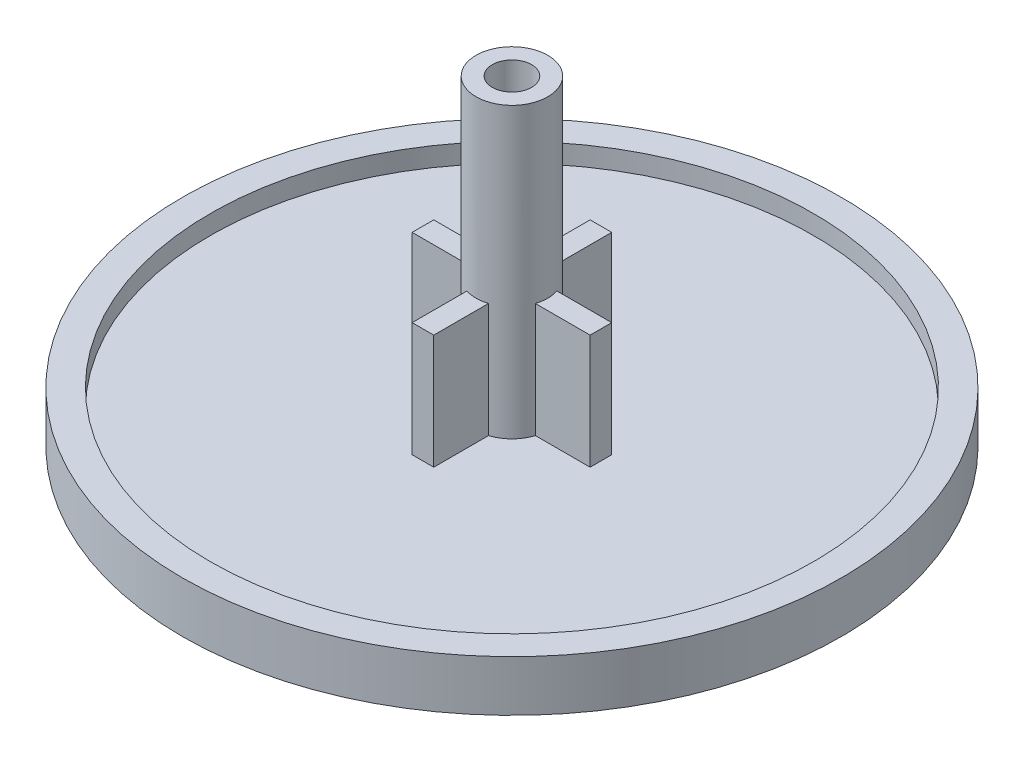
ISO-10303-21;
HEADER;
FILE_DESCRIPTION(('STEP AP214'),'2;1');
FILE_NAME('part.step','',(''),(''),'','','');
FILE_SCHEMA(('AUTOMOTIVE_DESIGN { 1 0 10303 214 1 1 1 1 }'));
ENDSEC;
DATA;
#1=APPLICATION_CONTEXT('core data for automotive mechanical design processes');
#2=APPLICATION_PROTOCOL_DEFINITION('international standard','automotive_design',2000,#1);
#3=PRODUCT_CONTEXT('',#1,'mechanical');
#4=PRODUCT('Part','Part','',(#3));
#5=PRODUCT_RELATED_PRODUCT_CATEGORY('part','',(#4));
#6=PRODUCT_DEFINITION_FORMATION('','',#4);
#7=PRODUCT_DEFINITION_CONTEXT('part definition',#1,'design');
#8=PRODUCT_DEFINITION('design','',#6,#7);
#9=PRODUCT_DEFINITION_SHAPE('','',#8);
#10=(LENGTH_UNIT() NAMED_UNIT(*) SI_UNIT(.MILLI.,.METRE.));
#11=(NAMED_UNIT(*) PLANE_ANGLE_UNIT() SI_UNIT($,.RADIAN.));
#12=(NAMED_UNIT(*) SI_UNIT($,.STERADIAN.) SOLID_ANGLE_UNIT());
#13=UNCERTAINTY_MEASURE_WITH_UNIT(LENGTH_MEASURE(1.E-05),#10,'distance_accuracy_value','');
#14=(GEOMETRIC_REPRESENTATION_CONTEXT(3) GLOBAL_UNCERTAINTY_ASSIGNED_CONTEXT((#13)) GLOBAL_UNIT_ASSIGNED_CONTEXT((#10,
#11,#12)) REPRESENTATION_CONTEXT('',''));
#15=CARTESIAN_POINT('',(0.,0.,0.));
#16=DIRECTION('',(0.,0.,1.));
#17=DIRECTION('',(1.,0.,0.));
#18=AXIS2_PLACEMENT_3D('',#15,#16,#17);
#19=CARTESIAN_POINT('',(0.,1.27,0.));
#20=DIRECTION('',(0.,1.,0.));
#21=DIRECTION('',(0.,0.,1.));
#22=AXIS2_PLACEMENT_3D('',#19,#20,#21);
#23=PLANE('',#22);
#24=CARTESIAN_POINT('',(0.,1.27,0.));
#25=DIRECTION('',(0.,1.,0.));
#26=DIRECTION('',(0.,0.,1.));
#27=AXIS2_PLACEMENT_3D('',#24,#25,#26);
#28=CIRCLE('',#27,12.0523);
#29=CARTESIAN_POINT('',(0.,1.27,12.0523));
#30=VERTEX_POINT('',#29);
#31=EDGE_CURVE('E265',#30,#30,#28,.F.);
#32=ORIENTED_EDGE('',*,*,#31,.F.);
#33=EDGE_LOOP('',(#32));
#34=FACE_BOUND('',#33,.T.);
#35=DIRECTION('',(1.,0.,0.));
#36=VECTOR('',#35,1.);
#37=CARTESIAN_POINT('',(0.,1.27,-3.556));
#38=LINE('',#37,#36);
#39=CARTESIAN_POINT('',(-0.4318,1.27,-3.556));
#40=VERTEX_POINT('',#39);
#41=CARTESIAN_POINT('',(0.4318,1.27,-3.556));
#42=VERTEX_POINT('',#41);
#43=EDGE_CURVE('E211',#40,#42,#38,.T.);
#44=ORIENTED_EDGE('',*,*,#43,.T.);
#45=DIRECTION('',(0.,0.,1.));
#46=VECTOR('',#45,1.);
#47=CARTESIAN_POINT('',(0.4318,1.27,0.));
#48=LINE('',#47,#46);
#49=CARTESIAN_POINT('',(0.4318,1.27,-1.36859810390048));
#50=VERTEX_POINT('',#49);
#51=EDGE_CURVE('E168',#42,#50,#48,.T.);
#52=ORIENTED_EDGE('',*,*,#51,.T.);
#53=CARTESIAN_POINT('',(0.,1.27,0.));
#54=DIRECTION('',(0.,1.,0.));
#55=DIRECTION('',(0.,0.,1.));
#56=AXIS2_PLACEMENT_3D('',#53,#54,#55);
#57=CIRCLE('',#56,1.4351);
#58=CARTESIAN_POINT('',(1.36859810390048,1.27,-0.4318));
#59=VERTEX_POINT('',#58);
#60=EDGE_CURVE('E251',#59,#50,#57,.T.);
#61=ORIENTED_EDGE('',*,*,#60,.F.);
#62=DIRECTION('',(-1.,0.,0.));
#63=VECTOR('',#62,1.);
#64=CARTESIAN_POINT('',(0.,1.27,-0.4318));
#65=LINE('',#64,#63);
#66=CARTESIAN_POINT('',(3.556,1.27,-0.4318));
#67=VERTEX_POINT('',#66);
#68=EDGE_CURVE('E242',#67,#59,#65,.T.);
#69=ORIENTED_EDGE('',*,*,#68,.F.);
#70=DIRECTION('',(0.,0.,1.));
#71=VECTOR('',#70,1.);
#72=CARTESIAN_POINT('',(3.556,1.27,0.));
#73=LINE('',#72,#71);
#74=CARTESIAN_POINT('',(3.556,1.27,0.4318));
#75=VERTEX_POINT('',#74);
#76=EDGE_CURVE('E285',#67,#75,#73,.T.);
#77=ORIENTED_EDGE('',*,*,#76,.T.);
#78=DIRECTION('',(-1.,0.,0.));
#79=VECTOR('',#78,1.);
#80=CARTESIAN_POINT('',(0.,1.27,0.4318));
#81=LINE('',#80,#79);
#82=CARTESIAN_POINT('',(1.36859810390048,1.27,0.4318));
#83=VERTEX_POINT('',#82);
#84=EDGE_CURVE('E246',#75,#83,#81,.T.);
#85=ORIENTED_EDGE('',*,*,#84,.T.);
#86=CARTESIAN_POINT('',(0.4318,1.27,1.36859810390048));
#87=VERTEX_POINT('',#86);
#88=EDGE_CURVE('E256',#87,#83,#57,.T.);
#89=ORIENTED_EDGE('',*,*,#88,.F.);
#90=CARTESIAN_POINT('',(0.4318,1.27,3.556));
#91=VERTEX_POINT('',#90);
#92=EDGE_CURVE('E206',#87,#91,#48,.T.);
#93=ORIENTED_EDGE('',*,*,#92,.T.);
#94=DIRECTION('',(-1.,0.,0.));
#95=VECTOR('',#94,1.);
#96=CARTESIAN_POINT('',(0.,1.27,3.556));
#97=LINE('',#96,#95);
#98=CARTESIAN_POINT('',(-0.4318,1.27,3.556));
#99=VERTEX_POINT('',#98);
#100=EDGE_CURVE('E213',#91,#99,#97,.T.);
#101=ORIENTED_EDGE('',*,*,#100,.T.);
#102=DIRECTION('',(0.,0.,1.));
#103=VECTOR('',#102,1.);
#104=CARTESIAN_POINT('',(-0.4318,1.27,0.));
#105=LINE('',#104,#103);
#106=CARTESIAN_POINT('',(-0.4318,1.27,1.36859810390048));
#107=VERTEX_POINT('',#106);
#108=EDGE_CURVE('E200',#107,#99,#105,.T.);
#109=ORIENTED_EDGE('',*,*,#108,.F.);
#110=CARTESIAN_POINT('',(-1.36859810390048,1.27,0.4318));
#111=VERTEX_POINT('',#110);
#112=EDGE_CURVE('E252',#111,#107,#57,.T.);
#113=ORIENTED_EDGE('',*,*,#112,.F.);
#114=CARTESIAN_POINT('',(-3.556,1.27,0.4318));
#115=VERTEX_POINT('',#114);
#116=EDGE_CURVE('E243',#111,#115,#81,.T.);
#117=ORIENTED_EDGE('',*,*,#116,.T.);
#118=DIRECTION('',(0.,0.,-1.));
#119=VECTOR('',#118,1.);
#120=CARTESIAN_POINT('',(-3.556,1.27,0.));
#121=LINE('',#120,#119);
#122=CARTESIAN_POINT('',(-3.556,1.27,-0.4318));
#123=VERTEX_POINT('',#122);
#124=EDGE_CURVE('E283',#115,#123,#121,.T.);
#125=ORIENTED_EDGE('',*,*,#124,.T.);
#126=CARTESIAN_POINT('',(-1.36859810390048,1.27,-0.4318));
#127=VERTEX_POINT('',#126);
#128=EDGE_CURVE('E240',#127,#123,#65,.T.);
#129=ORIENTED_EDGE('',*,*,#128,.F.);
#130=CARTESIAN_POINT('',(-0.4318,1.27,-1.36859810390048));
#131=VERTEX_POINT('',#130);
#132=EDGE_CURVE('E255',#131,#127,#57,.T.);
#133=ORIENTED_EDGE('',*,*,#132,.F.);
#134=EDGE_CURVE('E71',#40,#131,#105,.T.);
#135=ORIENTED_EDGE('',*,*,#134,.F.);
#136=EDGE_LOOP('',(#44,#52,#61,#69,#77,#85,#89,#93,#101,#109,#113,#117,#125,#129,#133,#135));
#137=FACE_BOUND('',#136,.T.);
#138=ADVANCED_FACE('F48',(#34,#137),#23,.T.);
#139=CARTESIAN_POINT('',(0.,12.8143,0.));
#140=DIRECTION('',(0.,-1.,0.));
#141=DIRECTION('',(0.,0.,-1.));
#142=AXIS2_PLACEMENT_3D('',#139,#140,#141);
#143=CYLINDRICAL_SURFACE('',#142,1.4351);
#144=CARTESIAN_POINT('',(0.,12.8143,0.));
#145=DIRECTION('',(0.,1.,0.));
#146=DIRECTION('',(0.,0.,1.));
#147=AXIS2_PLACEMENT_3D('',#144,#145,#146);
#148=CIRCLE('',#147,1.4351);
#149=CARTESIAN_POINT('',(0.,12.8143,1.4351));
#150=VERTEX_POINT('',#149);
#151=EDGE_CURVE('E247',#150,#150,#148,.T.);
#152=ORIENTED_EDGE('',*,*,#151,.F.);
#153=EDGE_LOOP('',(#152));
#154=FACE_BOUND('',#153,.T.);
#155=DIRECTION('',(0.,-1.,0.));
#156=VECTOR('',#155,1.);
#157=CARTESIAN_POINT('',(0.4318,12.8143,-1.36859810390048));
#158=LINE('',#157,#156);
#159=CARTESIAN_POINT('',(0.4318,5.842,-1.36859810390048));
#160=VERTEX_POINT('',#159);
#161=EDGE_CURVE('E209',#160,#50,#158,.T.);
#162=ORIENTED_EDGE('',*,*,#161,.F.);
#163=CARTESIAN_POINT('',(0.,5.842,0.));
#164=DIRECTION('',(0.,-1.,0.));
#165=DIRECTION('',(0.,0.,-1.));
#166=AXIS2_PLACEMENT_3D('',#163,#164,#165);
#167=CIRCLE('',#166,1.4351);
#168=CARTESIAN_POINT('',(-0.4318,5.842,-1.36859810390048));
#169=VERTEX_POINT('',#168);
#170=EDGE_CURVE('E13',#169,#160,#167,.T.);
#171=ORIENTED_EDGE('',*,*,#170,.F.);
#172=DIRECTION('',(0.,-1.,0.));
#173=VECTOR('',#172,1.);
#174=CARTESIAN_POINT('',(-0.4318,12.8143,-1.36859810390048));
#175=LINE('',#174,#173);
#176=EDGE_CURVE('E202',#169,#131,#175,.T.);
#177=ORIENTED_EDGE('',*,*,#176,.T.);
#178=ORIENTED_EDGE('',*,*,#132,.T.);
#179=DIRECTION('',(0.,-1.,0.));
#180=VECTOR('',#179,1.);
#181=CARTESIAN_POINT('',(-1.36859810390048,12.8143,-0.4318));
#182=LINE('',#181,#180);
#183=CARTESIAN_POINT('',(-1.36859810390048,5.842,-0.4318));
#184=VERTEX_POINT('',#183);
#185=EDGE_CURVE('E268',#127,#184,#182,.F.);
#186=ORIENTED_EDGE('',*,*,#185,.T.);
#187=CARTESIAN_POINT('',(0.,5.842,0.));
#188=DIRECTION('',(0.,-1.,0.));
#189=DIRECTION('',(0.,0.,-1.));
#190=AXIS2_PLACEMENT_3D('',#187,#188,#189);
#191=CIRCLE('',#190,1.4351);
#192=CARTESIAN_POINT('',(-1.36859810390048,5.842,0.4318));
#193=VERTEX_POINT('',#192);
#194=EDGE_CURVE('E271',#193,#184,#191,.T.);
#195=ORIENTED_EDGE('',*,*,#194,.F.);
#196=DIRECTION('',(0.,-1.,0.));
#197=VECTOR('',#196,1.);
#198=CARTESIAN_POINT('',(-1.36859810390048,12.8143,0.4318));
#199=LINE('',#198,#197);
#200=EDGE_CURVE('E274',#111,#193,#199,.F.);
#201=ORIENTED_EDGE('',*,*,#200,.F.);
#202=ORIENTED_EDGE('',*,*,#112,.T.);
#203=DIRECTION('',(0.,-1.,0.));
#204=VECTOR('',#203,1.);
#205=CARTESIAN_POINT('',(-0.4318,12.8143,1.36859810390048));
#206=LINE('',#205,#204);
#207=CARTESIAN_POINT('',(-0.4318,5.842,1.36859810390048));
#208=VERTEX_POINT('',#207);
#209=EDGE_CURVE('E181',#107,#208,#206,.F.);
#210=ORIENTED_EDGE('',*,*,#209,.T.);
#211=CARTESIAN_POINT('',(0.4318,5.842,1.36859810390048));
#212=VERTEX_POINT('',#211);
#213=EDGE_CURVE('E52',#212,#208,#167,.T.);
#214=ORIENTED_EDGE('',*,*,#213,.F.);
#215=DIRECTION('',(0.,-1.,0.));
#216=VECTOR('',#215,1.);
#217=CARTESIAN_POINT('',(0.4318,12.8143,1.36859810390048));
#218=LINE('',#217,#216);
#219=EDGE_CURVE('E204',#87,#212,#218,.F.);
#220=ORIENTED_EDGE('',*,*,#219,.F.);
#221=ORIENTED_EDGE('',*,*,#88,.T.);
#222=DIRECTION('',(0.,-1.,0.));
#223=VECTOR('',#222,1.);
#224=CARTESIAN_POINT('',(1.36859810390048,12.8143,0.4318));
#225=LINE('',#224,#223);
#226=CARTESIAN_POINT('',(1.36859810390048,5.842,0.4318));
#227=VERTEX_POINT('',#226);
#228=EDGE_CURVE('E280',#227,#83,#225,.T.);
#229=ORIENTED_EDGE('',*,*,#228,.F.);
#230=CARTESIAN_POINT('',(1.36859810390048,5.842,-0.4318));
#231=VERTEX_POINT('',#230);
#232=EDGE_CURVE('E275',#231,#227,#191,.T.);
#233=ORIENTED_EDGE('',*,*,#232,.F.);
#234=DIRECTION('',(0.,-1.,0.));
#235=VECTOR('',#234,1.);
#236=CARTESIAN_POINT('',(1.36859810390048,12.8143,-0.4318));
#237=LINE('',#236,#235);
#238=EDGE_CURVE('E277',#231,#59,#237,.T.);
#239=ORIENTED_EDGE('',*,*,#238,.T.);
#240=ORIENTED_EDGE('',*,*,#60,.T.);
#241=EDGE_LOOP('',(#162,#171,#177,#178,#186,#195,#201,#202,#210,#214,#220,#221,#229,#233,#239,#240));
#242=FACE_BOUND('',#241,.T.);
#243=ADVANCED_FACE('F297',(#154,#242),#143,.T.);
#244=CARTESIAN_POINT('',(0.,1.27,0.));
#245=DIRECTION('',(0.,-1.,0.));
#246=DIRECTION('',(0.,0.,-1.));
#247=AXIS2_PLACEMENT_3D('',#244,#245,#246);
#248=CYLINDRICAL_SURFACE('',#247,13.1699);
#249=CARTESIAN_POINT('',(0.,0.,0.));
#250=DIRECTION('',(0.,1.,0.));
#251=DIRECTION('',(0.,0.,1.));
#252=AXIS2_PLACEMENT_3D('',#249,#250,#251);
#253=CIRCLE('',#252,13.1699);
#254=CARTESIAN_POINT('',(0.,0.,13.1699));
#255=VERTEX_POINT('',#254);
#256=EDGE_CURVE('E262',#255,#255,#253,.T.);
#257=ORIENTED_EDGE('',*,*,#256,.T.);
#258=EDGE_LOOP('',(#257));
#259=FACE_BOUND('',#258,.T.);
#260=CARTESIAN_POINT('',(0.,2.032,0.));
#261=DIRECTION('',(0.,1.,0.));
#262=DIRECTION('',(0.,0.,1.));
#263=AXIS2_PLACEMENT_3D('',#260,#261,#262);
#264=CIRCLE('',#263,13.1699);
#265=CARTESIAN_POINT('',(0.,2.032,13.1699));
#266=VERTEX_POINT('',#265);
#267=EDGE_CURVE('E259',#266,#266,#264,.T.);
#268=ORIENTED_EDGE('',*,*,#267,.F.);
#269=EDGE_LOOP('',(#268));
#270=FACE_BOUND('',#269,.T.);
#271=ADVANCED_FACE('F50',(#259,#270),#248,.T.);
#272=CARTESIAN_POINT('',(0.,0.,0.));
#273=DIRECTION('',(0.,1.,0.));
#274=DIRECTION('',(0.,0.,1.));
#275=AXIS2_PLACEMENT_3D('',#272,#273,#274);
#276=PLANE('',#275);
#277=ORIENTED_EDGE('',*,*,#256,.F.);
#278=EDGE_LOOP('',(#277));
#279=FACE_BOUND('',#278,.T.);
#280=ADVANCED_FACE('F332',(#279),#276,.F.);
#281=CARTESIAN_POINT('',(0.,2.032,0.));
#282=DIRECTION('',(0.,1.,0.));
#283=DIRECTION('',(0.,0.,1.));
#284=AXIS2_PLACEMENT_3D('',#281,#282,#283);
#285=PLANE('',#284);
#286=ORIENTED_EDGE('',*,*,#267,.T.);
#287=EDGE_LOOP('',(#286));
#288=FACE_BOUND('',#287,.T.);
#289=CARTESIAN_POINT('',(0.,2.032,0.));
#290=DIRECTION('',(0.,1.,0.));
#291=DIRECTION('',(0.,0.,1.));
#292=AXIS2_PLACEMENT_3D('',#289,#290,#291);
#293=CIRCLE('',#292,12.0523);
#294=CARTESIAN_POINT('',(0.,2.032,12.0523));
#295=VERTEX_POINT('',#294);
#296=EDGE_CURVE('E250',#295,#295,#293,.T.);
#297=ORIENTED_EDGE('',*,*,#296,.F.);
#298=EDGE_LOOP('',(#297));
#299=FACE_BOUND('',#298,.T.);
#300=ADVANCED_FACE('F340',(#288,#299),#285,.T.);
#301=CARTESIAN_POINT('',(0.,2.032,0.));
#302=DIRECTION('',(0.,-1.,0.));
#303=DIRECTION('',(0.,0.,-1.));
#304=AXIS2_PLACEMENT_3D('',#301,#302,#303);
#305=CYLINDRICAL_SURFACE('',#304,12.0523);
#306=ORIENTED_EDGE('',*,*,#296,.T.);
#307=EDGE_LOOP('',(#306));
#308=FACE_BOUND('',#307,.T.);
#309=ORIENTED_EDGE('',*,*,#31,.T.);
#310=EDGE_LOOP('',(#309));
#311=FACE_BOUND('',#310,.T.);
#312=ADVANCED_FACE('F322',(#308,#311),#305,.F.);
#313=CARTESIAN_POINT('',(0.,12.8143,0.));
#314=DIRECTION('',(0.,1.,0.));
#315=DIRECTION('',(0.,0.,1.));
#316=AXIS2_PLACEMENT_3D('',#313,#314,#315);
#317=PLANE('',#316);
#318=CARTESIAN_POINT('',(0.,12.8143,0.));
#319=DIRECTION('',(0.,1.,0.));
#320=DIRECTION('',(0.,0.,1.));
#321=AXIS2_PLACEMENT_3D('',#318,#319,#320);
#322=CIRCLE('',#321,0.7874);
#323=CARTESIAN_POINT('',(0.,12.8143,0.7874));
#324=VERTEX_POINT('',#323);
#325=EDGE_CURVE('E312',#324,#324,#322,.T.);
#326=ORIENTED_EDGE('',*,*,#325,.F.);
#327=EDGE_LOOP('',(#326));
#328=FACE_BOUND('',#327,.T.);
#329=ORIENTED_EDGE('',*,*,#151,.T.);
#330=EDGE_LOOP('',(#329));
#331=FACE_BOUND('',#330,.T.);
#332=ADVANCED_FACE('F318',(#328,#331),#317,.T.);
#333=CARTESIAN_POINT('',(0.,0.,-0.4318));
#334=DIRECTION('',(0.,0.,-1.));
#335=DIRECTION('',(-1.,0.,0.));
#336=AXIS2_PLACEMENT_3D('',#333,#334,#335);
#337=PLANE('',#336);
#338=ORIENTED_EDGE('',*,*,#185,.F.);
#339=ORIENTED_EDGE('',*,*,#128,.T.);
#340=DIRECTION('',(0.,-1.,0.));
#341=VECTOR('',#340,1.);
#342=CARTESIAN_POINT('',(-3.556,0.,-0.4318));
#343=LINE('',#342,#341);
#344=CARTESIAN_POINT('',(-3.556,5.842,-0.4318));
#345=VERTEX_POINT('',#344);
#346=EDGE_CURVE('E216',#345,#123,#343,.T.);
#347=ORIENTED_EDGE('',*,*,#346,.F.);
#348=DIRECTION('',(-1.,0.,0.));
#349=VECTOR('',#348,1.);
#350=CARTESIAN_POINT('',(-3.556,5.842,-0.4318));
#351=LINE('',#350,#349);
#352=EDGE_CURVE('E232',#184,#345,#351,.T.);
#353=ORIENTED_EDGE('',*,*,#352,.F.);
#354=EDGE_LOOP('',(#338,#339,#347,#353));
#355=FACE_BOUND('',#354,.T.);
#356=ADVANCED_FACE('F321',(#355),#337,.T.);
#357=CARTESIAN_POINT('',(0.,0.,0.4318));
#358=DIRECTION('',(0.,0.,-1.));
#359=DIRECTION('',(-1.,0.,0.));
#360=AXIS2_PLACEMENT_3D('',#357,#358,#359);
#361=PLANE('',#360);
#362=ORIENTED_EDGE('',*,*,#116,.F.);
#363=ORIENTED_EDGE('',*,*,#200,.T.);
#364=DIRECTION('',(-1.,0.,0.));
#365=VECTOR('',#364,1.);
#366=CARTESIAN_POINT('',(-3.556,5.842,0.4318));
#367=LINE('',#366,#365);
#368=CARTESIAN_POINT('',(-3.556,5.842,0.4318));
#369=VERTEX_POINT('',#368);
#370=EDGE_CURVE('E223',#193,#369,#367,.T.);
#371=ORIENTED_EDGE('',*,*,#370,.T.);
#372=DIRECTION('',(0.,-1.,0.));
#373=VECTOR('',#372,1.);
#374=CARTESIAN_POINT('',(-3.556,0.,0.4318));
#375=LINE('',#374,#373);
#376=EDGE_CURVE('E217',#369,#115,#375,.T.);
#377=ORIENTED_EDGE('',*,*,#376,.T.);
#378=EDGE_LOOP('',(#362,#363,#371,#377));
#379=FACE_BOUND('',#378,.T.);
#380=ADVANCED_FACE('F378',(#379),#361,.F.);
#381=CARTESIAN_POINT('',(-3.556,5.842,0.4318));
#382=DIRECTION('',(0.,-1.,0.));
#383=DIRECTION('',(0.,0.,-1.));
#384=AXIS2_PLACEMENT_3D('',#381,#382,#383);
#385=PLANE('',#384);
#386=ORIENTED_EDGE('',*,*,#370,.F.);
#387=ORIENTED_EDGE('',*,*,#194,.T.);
#388=ORIENTED_EDGE('',*,*,#352,.T.);
#389=DIRECTION('',(0.,0.,-1.));
#390=VECTOR('',#389,1.);
#391=CARTESIAN_POINT('',(-3.556,5.842,0.4318));
#392=LINE('',#391,#390);
#393=EDGE_CURVE('E227',#369,#345,#392,.T.);
#394=ORIENTED_EDGE('',*,*,#393,.F.);
#395=EDGE_LOOP('',(#386,#387,#388,#394));
#396=FACE_BOUND('',#395,.T.);
#397=ADVANCED_FACE('F387',(#396),#385,.F.);
#398=CARTESIAN_POINT('',(-3.556,0.,0.4318));
#399=DIRECTION('',(1.,0.,0.));
#400=DIRECTION('',(0.,0.,-1.));
#401=AXIS2_PLACEMENT_3D('',#398,#399,#400);
#402=PLANE('',#401);
#403=ORIENTED_EDGE('',*,*,#124,.F.);
#404=ORIENTED_EDGE('',*,*,#376,.F.);
#405=ORIENTED_EDGE('',*,*,#393,.T.);
#406=ORIENTED_EDGE('',*,*,#346,.T.);
#407=EDGE_LOOP('',(#403,#404,#405,#406));
#408=FACE_BOUND('',#407,.T.);
#409=ADVANCED_FACE('F396',(#408),#402,.F.);
#410=CARTESIAN_POINT('',(3.556,5.842,-0.4318));
#411=VERTEX_POINT('',#410);
#412=EDGE_CURVE('E221',#411,#231,#351,.T.);
#413=ORIENTED_EDGE('',*,*,#412,.T.);
#414=ORIENTED_EDGE('',*,*,#232,.T.);
#415=CARTESIAN_POINT('',(3.556,5.842,0.4318));
#416=VERTEX_POINT('',#415);
#417=EDGE_CURVE('E224',#416,#227,#367,.T.);
#418=ORIENTED_EDGE('',*,*,#417,.F.);
#419=DIRECTION('',(0.,0.,-1.));
#420=VECTOR('',#419,1.);
#421=CARTESIAN_POINT('',(3.556,5.842,0.4318));
#422=LINE('',#421,#420);
#423=EDGE_CURVE('E237',#416,#411,#422,.T.);
#424=ORIENTED_EDGE('',*,*,#423,.T.);
#425=EDGE_LOOP('',(#413,#414,#418,#424));
#426=FACE_BOUND('',#425,.T.);
#427=ADVANCED_FACE('F399',(#426),#385,.F.);
#428=ORIENTED_EDGE('',*,*,#84,.F.);
#429=DIRECTION('',(0.,1.,0.));
#430=VECTOR('',#429,1.);
#431=CARTESIAN_POINT('',(3.556,0.,0.4318));
#432=LINE('',#431,#430);
#433=EDGE_CURVE('E220',#75,#416,#432,.T.);
#434=ORIENTED_EDGE('',*,*,#433,.T.);
#435=ORIENTED_EDGE('',*,*,#417,.T.);
#436=ORIENTED_EDGE('',*,*,#228,.T.);
#437=EDGE_LOOP('',(#428,#434,#435,#436));
#438=FACE_BOUND('',#437,.T.);
#439=ADVANCED_FACE('F390',(#438),#361,.F.);
#440=DIRECTION('',(0.,1.,0.));
#441=VECTOR('',#440,1.);
#442=CARTESIAN_POINT('',(3.556,0.,-0.4318));
#443=LINE('',#442,#441);
#444=EDGE_CURVE('E230',#67,#411,#443,.T.);
#445=ORIENTED_EDGE('',*,*,#444,.F.);
#446=ORIENTED_EDGE('',*,*,#68,.T.);
#447=ORIENTED_EDGE('',*,*,#238,.F.);
#448=ORIENTED_EDGE('',*,*,#412,.F.);
#449=EDGE_LOOP('',(#445,#446,#447,#448));
#450=FACE_BOUND('',#449,.T.);
#451=ADVANCED_FACE('F381',(#450),#337,.T.);
#452=CARTESIAN_POINT('',(3.556,0.,0.4318));
#453=DIRECTION('',(-1.,0.,0.));
#454=DIRECTION('',(0.,0.,1.));
#455=AXIS2_PLACEMENT_3D('',#452,#453,#454);
#456=PLANE('',#455);
#457=ORIENTED_EDGE('',*,*,#76,.F.);
#458=ORIENTED_EDGE('',*,*,#444,.T.);
#459=ORIENTED_EDGE('',*,*,#423,.F.);
#460=ORIENTED_EDGE('',*,*,#433,.F.);
#461=EDGE_LOOP('',(#457,#458,#459,#460));
#462=FACE_BOUND('',#461,.T.);
#463=ADVANCED_FACE('F423',(#462),#456,.F.);
#464=CARTESIAN_POINT('',(-0.4318,0.,0.));
#465=DIRECTION('',(-1.,0.,0.));
#466=DIRECTION('',(0.,0.,1.));
#467=AXIS2_PLACEMENT_3D('',#464,#465,#466);
#468=PLANE('',#467);
#469=ORIENTED_EDGE('',*,*,#209,.F.);
#470=ORIENTED_EDGE('',*,*,#108,.T.);
#471=DIRECTION('',(0.,-1.,0.));
#472=VECTOR('',#471,1.);
#473=CARTESIAN_POINT('',(-0.4318,0.,3.556));
#474=LINE('',#473,#472);
#475=CARTESIAN_POINT('',(-0.4318,5.842,3.556));
#476=VERTEX_POINT('',#475);
#477=EDGE_CURVE('E191',#476,#99,#474,.T.);
#478=ORIENTED_EDGE('',*,*,#477,.F.);
#479=DIRECTION('',(0.,0.,1.));
#480=VECTOR('',#479,1.);
#481=CARTESIAN_POINT('',(-0.4318,5.842,3.556));
#482=LINE('',#481,#480);
#483=EDGE_CURVE('E63',#208,#476,#482,.T.);
#484=ORIENTED_EDGE('',*,*,#483,.F.);
#485=EDGE_LOOP('',(#469,#470,#478,#484));
#486=FACE_BOUND('',#485,.T.);
#487=ADVANCED_FACE('F301',(#486),#468,.T.);
#488=CARTESIAN_POINT('',(0.4318,0.,0.));
#489=DIRECTION('',(-1.,0.,0.));
#490=DIRECTION('',(0.,0.,1.));
#491=AXIS2_PLACEMENT_3D('',#488,#489,#490);
#492=PLANE('',#491);
#493=ORIENTED_EDGE('',*,*,#92,.F.);
#494=ORIENTED_EDGE('',*,*,#219,.T.);
#495=DIRECTION('',(0.,0.,1.));
#496=VECTOR('',#495,1.);
#497=CARTESIAN_POINT('',(0.4318,5.842,3.556));
#498=LINE('',#497,#496);
#499=CARTESIAN_POINT('',(0.4318,5.842,3.556));
#500=VERTEX_POINT('',#499);
#501=EDGE_CURVE('E171',#212,#500,#498,.T.);
#502=ORIENTED_EDGE('',*,*,#501,.T.);
#503=DIRECTION('',(0.,-1.,0.));
#504=VECTOR('',#503,1.);
#505=CARTESIAN_POINT('',(0.4318,0.,3.556));
#506=LINE('',#505,#504);
#507=EDGE_CURVE('E172',#500,#91,#506,.T.);
#508=ORIENTED_EDGE('',*,*,#507,.T.);
#509=EDGE_LOOP('',(#493,#494,#502,#508));
#510=FACE_BOUND('',#509,.T.);
#511=ADVANCED_FACE('F308',(#510),#492,.F.);
#512=CARTESIAN_POINT('',(0.4318,5.842,3.556));
#513=DIRECTION('',(0.,-1.,0.));
#514=DIRECTION('',(0.,0.,-1.));
#515=AXIS2_PLACEMENT_3D('',#512,#513,#514);
#516=PLANE('',#515);
#517=ORIENTED_EDGE('',*,*,#501,.F.);
#518=ORIENTED_EDGE('',*,*,#213,.T.);
#519=ORIENTED_EDGE('',*,*,#483,.T.);
#520=DIRECTION('',(-1.,0.,0.));
#521=VECTOR('',#520,1.);
#522=CARTESIAN_POINT('',(0.4318,5.842,3.556));
#523=LINE('',#522,#521);
#524=EDGE_CURVE('E182',#500,#476,#523,.T.);
#525=ORIENTED_EDGE('',*,*,#524,.F.);
#526=EDGE_LOOP('',(#517,#518,#519,#525));
#527=FACE_BOUND('',#526,.T.);
#528=ADVANCED_FACE('F293',(#527),#516,.F.);
#529=CARTESIAN_POINT('',(0.4318,0.,3.556));
#530=DIRECTION('',(0.,0.,-1.));
#531=DIRECTION('',(-1.,0.,0.));
#532=AXIS2_PLACEMENT_3D('',#529,#530,#531);
#533=PLANE('',#532);
#534=ORIENTED_EDGE('',*,*,#100,.F.);
#535=ORIENTED_EDGE('',*,*,#507,.F.);
#536=ORIENTED_EDGE('',*,*,#524,.T.);
#537=ORIENTED_EDGE('',*,*,#477,.T.);
#538=EDGE_LOOP('',(#534,#535,#536,#537));
#539=FACE_BOUND('',#538,.T.);
#540=ADVANCED_FACE('F306',(#539),#533,.F.);
#541=ORIENTED_EDGE('',*,*,#51,.F.);
#542=DIRECTION('',(0.,1.,0.));
#543=VECTOR('',#542,1.);
#544=CARTESIAN_POINT('',(0.4318,0.,-3.556));
#545=LINE('',#544,#543);
#546=CARTESIAN_POINT('',(0.4318,5.842,-3.556));
#547=VERTEX_POINT('',#546);
#548=EDGE_CURVE('E161',#42,#547,#545,.T.);
#549=ORIENTED_EDGE('',*,*,#548,.T.);
#550=EDGE_CURVE('E165',#547,#160,#498,.T.);
#551=ORIENTED_EDGE('',*,*,#550,.T.);
#552=ORIENTED_EDGE('',*,*,#161,.T.);
#553=EDGE_LOOP('',(#541,#549,#551,#552));
#554=FACE_BOUND('',#553,.T.);
#555=ADVANCED_FACE('F163',(#554),#492,.F.);
#556=DIRECTION('',(0.,1.,0.));
#557=VECTOR('',#556,1.);
#558=CARTESIAN_POINT('',(-0.4318,0.,-3.556));
#559=LINE('',#558,#557);
#560=CARTESIAN_POINT('',(-0.4318,5.842,-3.556));
#561=VERTEX_POINT('',#560);
#562=EDGE_CURVE('E177',#40,#561,#559,.T.);
#563=ORIENTED_EDGE('',*,*,#562,.F.);
#564=ORIENTED_EDGE('',*,*,#134,.T.);
#565=ORIENTED_EDGE('',*,*,#176,.F.);
#566=EDGE_CURVE('E196',#561,#169,#482,.T.);
#567=ORIENTED_EDGE('',*,*,#566,.F.);
#568=EDGE_LOOP('',(#563,#564,#565,#567));
#569=FACE_BOUND('',#568,.T.);
#570=ADVANCED_FACE('F438',(#569),#468,.T.);
#571=CARTESIAN_POINT('',(0.4318,0.,-3.556));
#572=DIRECTION('',(0.,0.,1.));
#573=DIRECTION('',(1.,0.,0.));
#574=AXIS2_PLACEMENT_3D('',#571,#572,#573);
#575=PLANE('',#574);
#576=ORIENTED_EDGE('',*,*,#43,.F.);
#577=ORIENTED_EDGE('',*,*,#562,.T.);
#578=DIRECTION('',(-1.,0.,0.));
#579=VECTOR('',#578,1.);
#580=CARTESIAN_POINT('',(0.4318,5.842,-3.556));
#581=LINE('',#580,#579);
#582=EDGE_CURVE('E175',#547,#561,#581,.T.);
#583=ORIENTED_EDGE('',*,*,#582,.F.);
#584=ORIENTED_EDGE('',*,*,#548,.F.);
#585=EDGE_LOOP('',(#576,#577,#583,#584));
#586=FACE_BOUND('',#585,.T.);
#587=ADVANCED_FACE('F176',(#586),#575,.F.);
#588=ORIENTED_EDGE('',*,*,#566,.T.);
#589=ORIENTED_EDGE('',*,*,#170,.T.);
#590=ORIENTED_EDGE('',*,*,#550,.F.);
#591=ORIENTED_EDGE('',*,*,#582,.T.);
#592=EDGE_LOOP('',(#588,#589,#590,#591));
#593=FACE_BOUND('',#592,.T.);
#594=ADVANCED_FACE('F184',(#593),#516,.F.);
#595=CARTESIAN_POINT('',(0.,-0.957103518025151,0.));
#596=DIRECTION('',(0.,1.,0.));
#597=DIRECTION('',(0.,0.,1.));
#598=AXIS2_PLACEMENT_3D('',#595,#596,#597);
#599=CYLINDRICAL_SURFACE('',#598,0.7874);
#600=CARTESIAN_POINT('',(0.,1.27,0.));
#601=DIRECTION('',(0.,1.,0.));
#602=DIRECTION('',(0.,0.,1.));
#603=AXIS2_PLACEMENT_3D('',#600,#601,#602);
#604=CIRCLE('',#603,0.7874);
#605=CARTESIAN_POINT('',(0.,1.27,0.7874));
#606=VERTEX_POINT('',#605);
#607=EDGE_CURVE('E194',#606,#606,#604,.F.);
#608=ORIENTED_EDGE('',*,*,#607,.T.);
#609=EDGE_LOOP('',(#608));
#610=FACE_BOUND('',#609,.T.);
#611=ORIENTED_EDGE('',*,*,#325,.T.);
#612=EDGE_LOOP('',(#611));
#613=FACE_BOUND('',#612,.T.);
#614=ADVANCED_FACE('F316',(#610,#613),#599,.F.);
#615=CARTESIAN_POINT('',(0.,1.27,0.));
#616=DIRECTION('',(0.,1.,0.));
#617=DIRECTION('',(0.,0.,1.));
#618=AXIS2_PLACEMENT_3D('',#615,#616,#617);
#619=PLANE('',#618);
#620=ORIENTED_EDGE('',*,*,#607,.F.);
#621=EDGE_LOOP('',(#620));
#622=FACE_BOUND('',#621,.T.);
#623=ADVANCED_FACE('F481',(#622),#619,.T.);
#624=CLOSED_SHELL('',(#138,#243,#271,#280,#300,#312,#332,#356,#380,#397,#409,#427,#439,#451,
#463,#487,#511,#528,#540,#555,#570,#587,#594,#614,#623));
#625=MANIFOLD_SOLID_BREP('B2',#624);
#626=ADVANCED_BREP_SHAPE_REPRESENTATION('',(#18,#625),#14);
#627=SHAPE_DEFINITION_REPRESENTATION(#9,#626);
ENDSEC;
END-ISO-10303-21;
